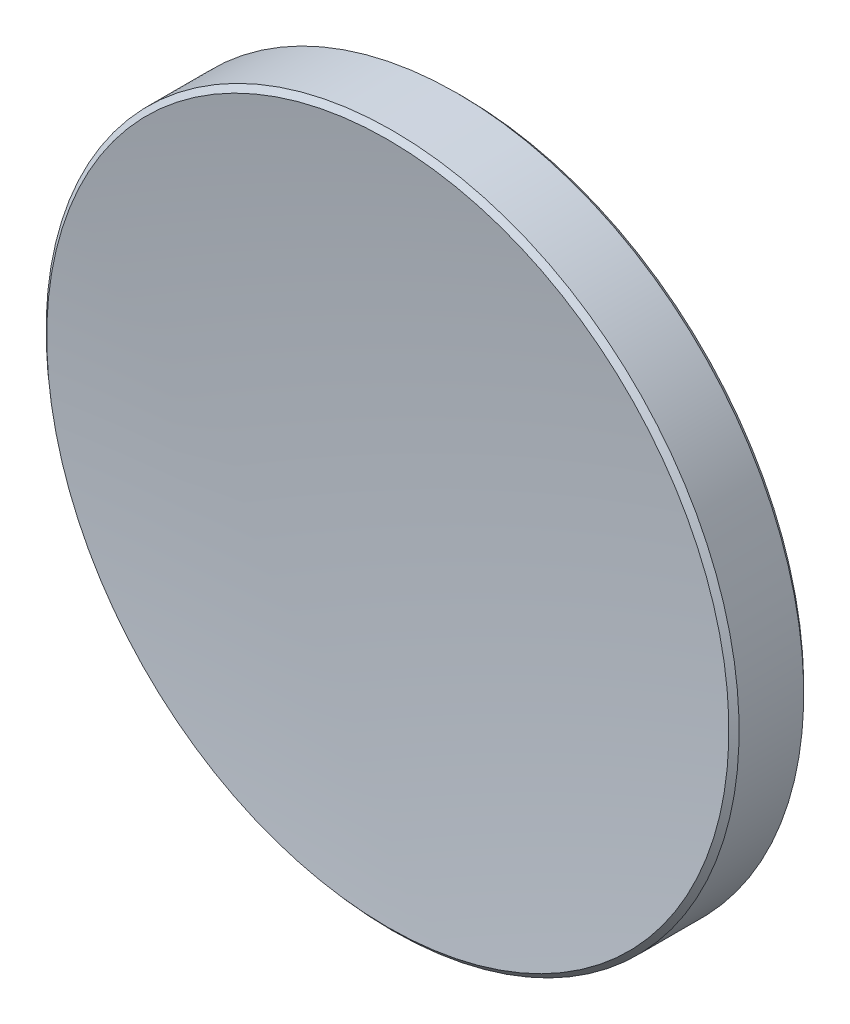
ISO-10303-21;
HEADER;
FILE_DESCRIPTION(('STEP AP214'),'2;1');
FILE_NAME('part.step','',(''),(''),'','','');
FILE_SCHEMA(('AUTOMOTIVE_DESIGN { 1 0 10303 214 1 1 1 1 }'));
ENDSEC;
DATA;
#1=APPLICATION_CONTEXT('core data for automotive mechanical design processes');
#2=APPLICATION_PROTOCOL_DEFINITION('international standard','automotive_design',2000,#1);
#3=PRODUCT_CONTEXT('',#1,'mechanical');
#4=PRODUCT('Part','Part','',(#3));
#5=PRODUCT_RELATED_PRODUCT_CATEGORY('part','',(#4));
#6=PRODUCT_DEFINITION_FORMATION('','',#4);
#7=PRODUCT_DEFINITION_CONTEXT('part definition',#1,'design');
#8=PRODUCT_DEFINITION('design','',#6,#7);
#9=PRODUCT_DEFINITION_SHAPE('','',#8);
#10=(LENGTH_UNIT() NAMED_UNIT(*) SI_UNIT(.MILLI.,.METRE.));
#11=(NAMED_UNIT(*) PLANE_ANGLE_UNIT() SI_UNIT($,.RADIAN.));
#12=(NAMED_UNIT(*) SI_UNIT($,.STERADIAN.) SOLID_ANGLE_UNIT());
#13=UNCERTAINTY_MEASURE_WITH_UNIT(LENGTH_MEASURE(1.E-05),#10,'distance_accuracy_value','');
#14=(GEOMETRIC_REPRESENTATION_CONTEXT(3) GLOBAL_UNCERTAINTY_ASSIGNED_CONTEXT((#13)) GLOBAL_UNIT_ASSIGNED_CONTEXT((#10,
#11,#12)) REPRESENTATION_CONTEXT('',''));
#15=CARTESIAN_POINT('',(0.,0.,0.));
#16=DIRECTION('',(0.,0.,1.));
#17=DIRECTION('',(1.,0.,0.));
#18=AXIS2_PLACEMENT_3D('',#15,#16,#17);
#19=CARTESIAN_POINT('',(0.,0.,-1.38470051795164));
#20=DIRECTION('',(0.,0.,-1.));
#21=DIRECTION('',(0.,1.,0.));
#22=AXIS2_PLACEMENT_3D('',#19,#20,#21);
#23=PLANE('',#22);
#24=CARTESIAN_POINT('',(0.,0.,-1.38470051795164));
#25=DIRECTION('',(0.,0.,-1.));
#26=DIRECTION('',(0.,1.,0.));
#27=AXIS2_PLACEMENT_3D('',#24,#25,#26);
#28=CIRCLE('',#27,12.5);
#29=CARTESIAN_POINT('',(0.,12.5,-1.38470051795163));
#30=VERTEX_POINT('',#29);
#31=EDGE_CURVE('E28',#30,#30,#28,.T.);
#32=ORIENTED_EDGE('',*,*,#31,.T.);
#33=EDGE_LOOP('',(#32));
#34=FACE_BOUND('',#33,.T.);
#35=ADVANCED_FACE('F13',(#34),#23,.T.);
#36=CARTESIAN_POINT('',(0.,0.,-1.38470051795163));
#37=DIRECTION('',(0.,0.,-1.));
#38=DIRECTION('',(0.,1.,0.));
#39=AXIS2_PLACEMENT_3D('',#36,#37,#38);
#40=CYLINDRICAL_SURFACE('',#39,12.7);
#41=CARTESIAN_POINT('',(0.,0.,-1.18470051795164));
#42=DIRECTION('',(0.,0.,-1.));
#43=DIRECTION('',(0.,1.,0.));
#44=AXIS2_PLACEMENT_3D('',#41,#42,#43);
#45=CIRCLE('',#44,12.7);
#46=CARTESIAN_POINT('',(0.,12.7,-1.18470051795164));
#47=VERTEX_POINT('',#46);
#48=EDGE_CURVE('E20',#47,#47,#45,.F.);
#49=ORIENTED_EDGE('',*,*,#48,.T.);
#50=EDGE_LOOP('',(#49));
#51=FACE_BOUND('',#50,.T.);
#52=CARTESIAN_POINT('',(0.,0.,1.18470051795166));
#53=DIRECTION('',(0.,0.,1.));
#54=DIRECTION('',(0.,-1.,0.));
#55=AXIS2_PLACEMENT_3D('',#52,#53,#54);
#56=CIRCLE('',#55,12.7);
#57=CARTESIAN_POINT('',(0.,-12.7,1.18470051795165));
#58=VERTEX_POINT('',#57);
#59=EDGE_CURVE('E24',#58,#58,#56,.F.);
#60=ORIENTED_EDGE('',*,*,#59,.T.);
#61=EDGE_LOOP('',(#60));
#62=FACE_BOUND('',#61,.T.);
#63=ADVANCED_FACE('F45',(#51,#62),#40,.T.);
#64=CARTESIAN_POINT('',(0.,0.,105.815299482048));
#65=DIRECTION('',(0.,0.,-1.));
#66=DIRECTION('',(0.,1.,0.));
#67=AXIS2_PLACEMENT_3D('',#64,#65,#66);
#68=SPHERICAL_SURFACE('',#67,105.2);
#69=CARTESIAN_POINT('',(0.,0.,1.36072471020123));
#70=DIRECTION('',(0.,0.,1.));
#71=DIRECTION('',(0.,-1.,0.));
#72=AXIS2_PLACEMENT_3D('',#69,#70,#71);
#73=CIRCLE('',#72,12.5012723045535);
#74=CARTESIAN_POINT('',(0.,-12.5012723045535,1.36072471020123));
#75=VERTEX_POINT('',#74);
#76=EDGE_CURVE('E9',#75,#75,#73,.T.);
#77=ORIENTED_EDGE('',*,*,#76,.T.);
#78=EDGE_LOOP('',(#77));
#79=FACE_BOUND('',#78,.T.);
#80=ADVANCED_FACE('F37',(#79),#68,.F.);
#81=CARTESIAN_POINT('',(0.,0.,-1.38470051795164));
#82=DIRECTION('',(0.,0.,1.));
#83=DIRECTION('',(0.,-1.,0.));
#84=AXIS2_PLACEMENT_3D('',#81,#82,#83);
#85=CONICAL_SURFACE('',#84,12.5,0.785398163397448);
#86=ORIENTED_EDGE('',*,*,#48,.F.);
#87=EDGE_LOOP('',(#86));
#88=FACE_BOUND('',#87,.T.);
#89=ORIENTED_EDGE('',*,*,#31,.F.);
#90=EDGE_LOOP('',(#89));
#91=FACE_BOUND('',#90,.T.);
#92=ADVANCED_FACE('F35',(#88,#91),#85,.T.);
#93=CARTESIAN_POINT('',(0.,0.,1.18470051795166));
#94=DIRECTION('',(0.,0.,-1.));
#95=DIRECTION('',(0.,1.,0.));
#96=AXIS2_PLACEMENT_3D('',#93,#94,#95);
#97=CONICAL_SURFACE('',#96,12.7,0.845906966550228);
#98=ORIENTED_EDGE('',*,*,#76,.F.);
#99=EDGE_LOOP('',(#98));
#100=FACE_BOUND('',#99,.T.);
#101=ORIENTED_EDGE('',*,*,#59,.F.);
#102=EDGE_LOOP('',(#101));
#103=FACE_BOUND('',#102,.T.);
#104=ADVANCED_FACE('F15',(#100,#103),#97,.T.);
#105=CLOSED_SHELL('',(#35,#63,#80,#92,#104));
#106=MANIFOLD_SOLID_BREP('B1',#105);
#107=ADVANCED_BREP_SHAPE_REPRESENTATION('',(#18,#106),#14);
#108=SHAPE_DEFINITION_REPRESENTATION(#9,#107);
ENDSEC;
END-ISO-10303-21;
